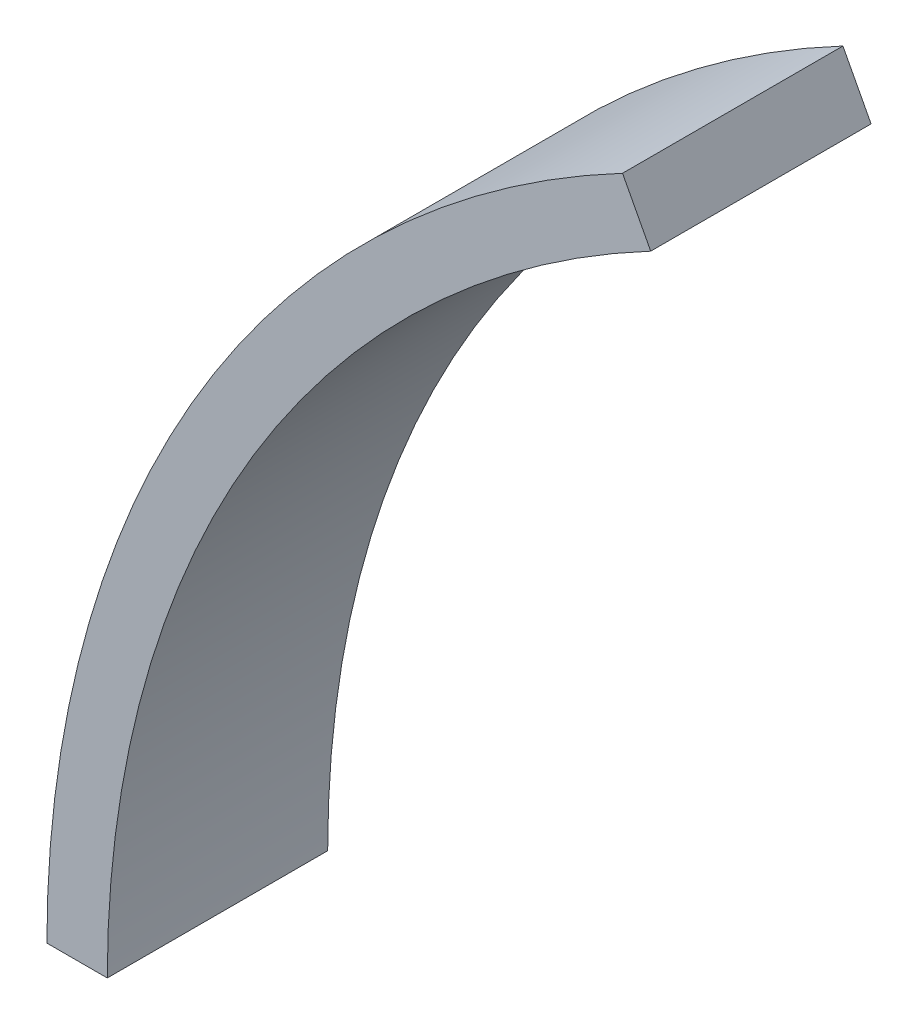
ISO-10303-21;
HEADER;
FILE_DESCRIPTION(('STEP AP214'),'2;1');
FILE_NAME('part.step','',(''),(''),'','','');
FILE_SCHEMA(('AUTOMOTIVE_DESIGN { 1 0 10303 214 1 1 1 1 }'));
ENDSEC;
DATA;
#1=APPLICATION_CONTEXT('core data for automotive mechanical design processes');
#2=APPLICATION_PROTOCOL_DEFINITION('international standard','automotive_design',2000,#1);
#3=PRODUCT_CONTEXT('',#1,'mechanical');
#4=PRODUCT('Part','Part','',(#3));
#5=PRODUCT_RELATED_PRODUCT_CATEGORY('part','',(#4));
#6=PRODUCT_DEFINITION_FORMATION('','',#4);
#7=PRODUCT_DEFINITION_CONTEXT('part definition',#1,'design');
#8=PRODUCT_DEFINITION('design','',#6,#7);
#9=PRODUCT_DEFINITION_SHAPE('','',#8);
#10=(LENGTH_UNIT() NAMED_UNIT(*) SI_UNIT(.MILLI.,.METRE.));
#11=(NAMED_UNIT(*) PLANE_ANGLE_UNIT() SI_UNIT($,.RADIAN.));
#12=(NAMED_UNIT(*) SI_UNIT($,.STERADIAN.) SOLID_ANGLE_UNIT());
#13=UNCERTAINTY_MEASURE_WITH_UNIT(LENGTH_MEASURE(1.E-05),#10,'distance_accuracy_value','');
#14=(GEOMETRIC_REPRESENTATION_CONTEXT(3) GLOBAL_UNCERTAINTY_ASSIGNED_CONTEXT((#13)) GLOBAL_UNIT_ASSIGNED_CONTEXT((#10,
#11,#12)) REPRESENTATION_CONTEXT('',''));
#15=CARTESIAN_POINT('',(0.,0.,0.));
#16=DIRECTION('',(0.,0.,1.));
#17=DIRECTION('',(1.,0.,0.));
#18=AXIS2_PLACEMENT_3D('',#15,#16,#17);
#19=CARTESIAN_POINT('',(0.,0.,4.6355));
#20=DIRECTION('',(0.,0.,-1.));
#21=DIRECTION('',(-1.,0.,0.));
#22=AXIS2_PLACEMENT_3D('',#19,#20,#21);
#23=CYLINDRICAL_SURFACE('',#22,42.8625);
#24=CARTESIAN_POINT('',(0.,0.,-4.6355));
#25=DIRECTION('',(0.,0.,-1.));
#26=DIRECTION('',(-1.,0.,0.));
#27=AXIS2_PLACEMENT_3D('',#24,#25,#26);
#28=CIRCLE('',#27,42.8625);
#29=CARTESIAN_POINT('',(-42.8625,0.,-4.6355));
#30=VERTEX_POINT('',#29);
#31=CARTESIAN_POINT('',(-20.0025,37.9090213537622,-4.6355));
#32=VERTEX_POINT('',#31);
#33=EDGE_CURVE('E111',#30,#32,#28,.T.);
#34=ORIENTED_EDGE('',*,*,#33,.T.);
#35=DIRECTION('',(0.,0.,-1.));
#36=VECTOR('',#35,1.);
#37=CARTESIAN_POINT('',(-20.0025,37.9090213537622,4.6355));
#38=LINE('',#37,#36);
#39=CARTESIAN_POINT('',(-20.0025,37.9090213537622,4.6355));
#40=VERTEX_POINT('',#39);
#41=EDGE_CURVE('E11',#40,#32,#38,.T.);
#42=ORIENTED_EDGE('',*,*,#41,.F.);
#43=CARTESIAN_POINT('',(0.,0.,4.6355));
#44=DIRECTION('',(0.,0.,-1.));
#45=DIRECTION('',(-1.,0.,0.));
#46=AXIS2_PLACEMENT_3D('',#43,#44,#45);
#47=CIRCLE('',#46,42.8625);
#48=CARTESIAN_POINT('',(-42.8625,0.,4.6355));
#49=VERTEX_POINT('',#48);
#50=EDGE_CURVE('E95',#49,#40,#47,.T.);
#51=ORIENTED_EDGE('',*,*,#50,.F.);
#52=DIRECTION('',(0.,0.,-1.));
#53=VECTOR('',#52,1.);
#54=CARTESIAN_POINT('',(-42.8625,0.,4.6355));
#55=LINE('',#54,#53);
#56=EDGE_CURVE('E107',#49,#30,#55,.T.);
#57=ORIENTED_EDGE('',*,*,#56,.T.);
#58=EDGE_LOOP('',(#34,#42,#51,#57));
#59=FACE_BOUND('',#58,.T.);
#60=ADVANCED_FACE('F43',(#59),#23,.F.);
#61=CARTESIAN_POINT('',(-20.0025,37.9090213537622,4.6355));
#62=DIRECTION('',(-0.884433277428106,-0.466666666666668,0.));
#63=DIRECTION('',(0.466666666666668,-0.884433277428106,0.));
#64=AXIS2_PLACEMENT_3D('',#61,#62,#63);
#65=PLANE('',#64);
#66=DIRECTION('',(-0.466666666666668,0.884433277428106,0.));
#67=VECTOR('',#66,1.);
#68=CARTESIAN_POINT('',(-20.0025,37.9090213537622,-4.6355));
#69=LINE('',#68,#67);
#70=CARTESIAN_POINT('',(-21.1878333333333,40.1554818784296,-4.6355));
#71=VERTEX_POINT('',#70);
#72=EDGE_CURVE('E100',#32,#71,#69,.T.);
#73=ORIENTED_EDGE('',*,*,#72,.T.);
#74=DIRECTION('',(0.,0.,-1.));
#75=VECTOR('',#74,1.);
#76=CARTESIAN_POINT('',(-21.1878333333333,40.1554818784296,4.6355));
#77=LINE('',#76,#75);
#78=CARTESIAN_POINT('',(-21.1878333333333,40.1554818784296,4.6355));
#79=VERTEX_POINT('',#78);
#80=EDGE_CURVE('E52',#79,#71,#77,.T.);
#81=ORIENTED_EDGE('',*,*,#80,.F.);
#82=DIRECTION('',(-0.466666666666668,0.884433277428106,0.));
#83=VECTOR('',#82,1.);
#84=CARTESIAN_POINT('',(-20.0025,37.9090213537622,4.6355));
#85=LINE('',#84,#83);
#86=EDGE_CURVE('E90',#40,#79,#85,.T.);
#87=ORIENTED_EDGE('',*,*,#86,.F.);
#88=ORIENTED_EDGE('',*,*,#41,.T.);
#89=EDGE_LOOP('',(#73,#81,#87,#88));
#90=FACE_BOUND('',#89,.T.);
#91=ADVANCED_FACE('F99',(#90),#65,.F.);
#92=CARTESIAN_POINT('',(0.,0.,4.6355));
#93=DIRECTION('',(0.,0.,-1.));
#94=DIRECTION('',(-1.,0.,0.));
#95=AXIS2_PLACEMENT_3D('',#92,#93,#94);
#96=CYLINDRICAL_SURFACE('',#95,45.4025);
#97=CARTESIAN_POINT('',(0.,0.,-4.6355));
#98=DIRECTION('',(0.,0.,1.));
#99=DIRECTION('',(-1.,0.,0.));
#100=AXIS2_PLACEMENT_3D('',#97,#98,#99);
#101=CIRCLE('',#100,45.4025);
#102=CARTESIAN_POINT('',(-45.4025,0.,-4.6355));
#103=VERTEX_POINT('',#102);
#104=EDGE_CURVE('E77',#71,#103,#101,.T.);
#105=ORIENTED_EDGE('',*,*,#104,.T.);
#106=DIRECTION('',(0.,0.,-1.));
#107=VECTOR('',#106,1.);
#108=CARTESIAN_POINT('',(-45.4025,0.,4.6355));
#109=LINE('',#108,#107);
#110=CARTESIAN_POINT('',(-45.4025,0.,4.6355));
#111=VERTEX_POINT('',#110);
#112=EDGE_CURVE('E102',#111,#103,#109,.T.);
#113=ORIENTED_EDGE('',*,*,#112,.F.);
#114=CARTESIAN_POINT('',(0.,0.,4.6355));
#115=DIRECTION('',(0.,0.,1.));
#116=DIRECTION('',(-1.,0.,0.));
#117=AXIS2_PLACEMENT_3D('',#114,#115,#116);
#118=CIRCLE('',#117,45.4025);
#119=EDGE_CURVE('E93',#79,#111,#118,.T.);
#120=ORIENTED_EDGE('',*,*,#119,.F.);
#121=ORIENTED_EDGE('',*,*,#80,.T.);
#122=EDGE_LOOP('',(#105,#113,#120,#121));
#123=FACE_BOUND('',#122,.T.);
#124=ADVANCED_FACE('F103',(#123),#96,.T.);
#125=CARTESIAN_POINT('',(-42.8625,0.,4.6355));
#126=DIRECTION('',(0.,1.,0.));
#127=DIRECTION('',(-1.,0.,0.));
#128=AXIS2_PLACEMENT_3D('',#125,#126,#127);
#129=PLANE('',#128);
#130=DIRECTION('',(1.,0.,0.));
#131=VECTOR('',#130,1.);
#132=CARTESIAN_POINT('',(-42.8625,0.,-4.6355));
#133=LINE('',#132,#131);
#134=EDGE_CURVE('E83',#103,#30,#133,.T.);
#135=ORIENTED_EDGE('',*,*,#134,.T.);
#136=ORIENTED_EDGE('',*,*,#56,.F.);
#137=DIRECTION('',(1.,0.,0.));
#138=VECTOR('',#137,1.);
#139=CARTESIAN_POINT('',(-42.8625,0.,4.6355));
#140=LINE('',#139,#138);
#141=EDGE_CURVE('E60',#111,#49,#140,.T.);
#142=ORIENTED_EDGE('',*,*,#141,.F.);
#143=ORIENTED_EDGE('',*,*,#112,.T.);
#144=EDGE_LOOP('',(#135,#136,#142,#143));
#145=FACE_BOUND('',#144,.T.);
#146=ADVANCED_FACE('F124',(#145),#129,.F.);
#147=CARTESIAN_POINT('',(0.,0.,4.6355));
#148=DIRECTION('',(0.,0.,-1.));
#149=DIRECTION('',(-1.,0.,0.));
#150=AXIS2_PLACEMENT_3D('',#147,#148,#149);
#151=PLANE('',#150);
#152=ORIENTED_EDGE('',*,*,#50,.T.);
#153=ORIENTED_EDGE('',*,*,#86,.T.);
#154=ORIENTED_EDGE('',*,*,#119,.T.);
#155=ORIENTED_EDGE('',*,*,#141,.T.);
#156=EDGE_LOOP('',(#152,#153,#154,#155));
#157=FACE_BOUND('',#156,.T.);
#158=ADVANCED_FACE('F91',(#157),#151,.F.);
#159=CARTESIAN_POINT('',(0.,0.,-4.6355));
#160=DIRECTION('',(0.,0.,-1.));
#161=DIRECTION('',(-1.,0.,0.));
#162=AXIS2_PLACEMENT_3D('',#159,#160,#161);
#163=PLANE('',#162);
#164=ORIENTED_EDGE('',*,*,#33,.F.);
#165=ORIENTED_EDGE('',*,*,#134,.F.);
#166=ORIENTED_EDGE('',*,*,#104,.F.);
#167=ORIENTED_EDGE('',*,*,#72,.F.);
#168=EDGE_LOOP('',(#164,#165,#166,#167));
#169=FACE_BOUND('',#168,.T.);
#170=ADVANCED_FACE('F127',(#169),#163,.T.);
#171=CLOSED_SHELL('',(#60,#91,#124,#146,#158,#170));
#172=MANIFOLD_SOLID_BREP('B2',#171);
#173=ADVANCED_BREP_SHAPE_REPRESENTATION('',(#18,#172),#14);
#174=SHAPE_DEFINITION_REPRESENTATION(#9,#173);
ENDSEC;
END-ISO-10303-21;
